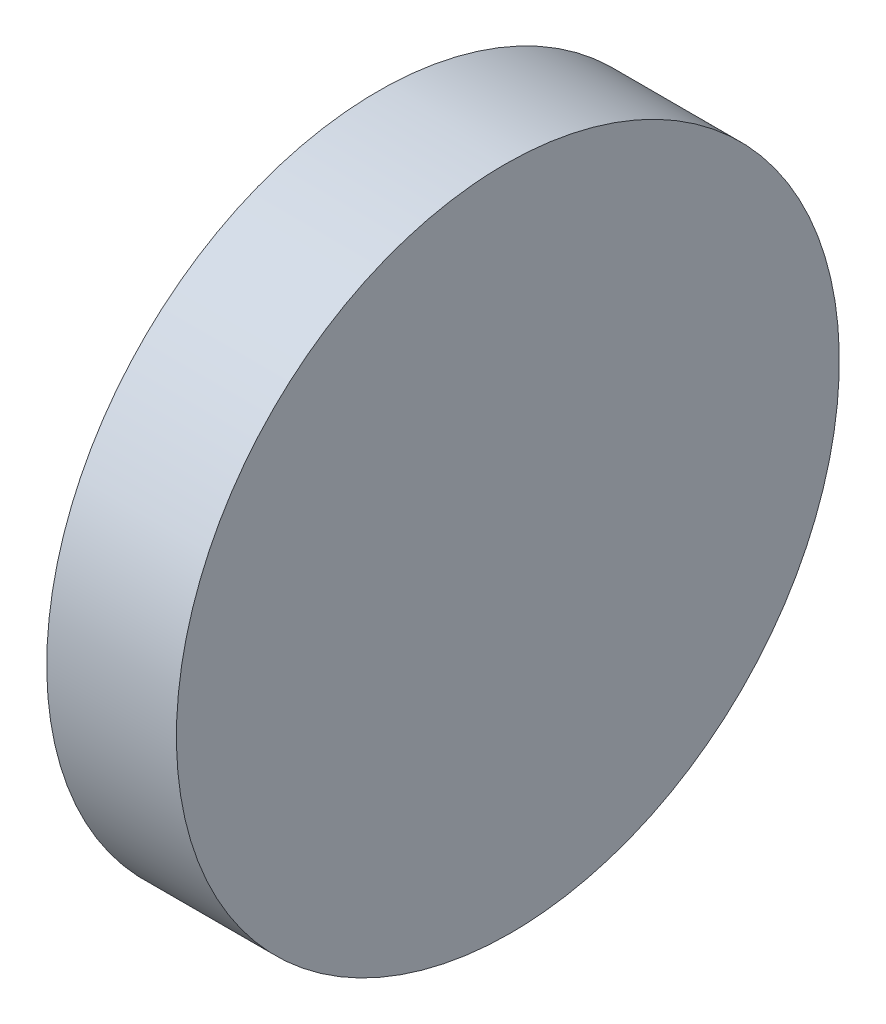
ISO-10303-21;
HEADER;
FILE_DESCRIPTION(('STEP AP214'),'2;1');
FILE_NAME('part.step','',(''),(''),'','','');
FILE_SCHEMA(('AUTOMOTIVE_DESIGN { 1 0 10303 214 1 1 1 1 }'));
ENDSEC;
DATA;
#1=APPLICATION_CONTEXT('core data for automotive mechanical design processes');
#2=APPLICATION_PROTOCOL_DEFINITION('international standard','automotive_design',2000,#1);
#3=PRODUCT_CONTEXT('',#1,'mechanical');
#4=PRODUCT('Part','Part','',(#3));
#5=PRODUCT_RELATED_PRODUCT_CATEGORY('part','',(#4));
#6=PRODUCT_DEFINITION_FORMATION('','',#4);
#7=PRODUCT_DEFINITION_CONTEXT('part definition',#1,'design');
#8=PRODUCT_DEFINITION('design','',#6,#7);
#9=PRODUCT_DEFINITION_SHAPE('','',#8);
#10=(LENGTH_UNIT() NAMED_UNIT(*) SI_UNIT(.MILLI.,.METRE.));
#11=(NAMED_UNIT(*) PLANE_ANGLE_UNIT() SI_UNIT($,.RADIAN.));
#12=(NAMED_UNIT(*) SI_UNIT($,.STERADIAN.) SOLID_ANGLE_UNIT());
#13=UNCERTAINTY_MEASURE_WITH_UNIT(LENGTH_MEASURE(1.E-05),#10,'distance_accuracy_value','');
#14=(GEOMETRIC_REPRESENTATION_CONTEXT(3) GLOBAL_UNCERTAINTY_ASSIGNED_CONTEXT((#13)) GLOBAL_UNIT_ASSIGNED_CONTEXT((#10,
#11,#12)) REPRESENTATION_CONTEXT('',''));
#15=CARTESIAN_POINT('',(0.,0.,0.));
#16=DIRECTION('',(0.,0.,1.));
#17=DIRECTION('',(1.,0.,0.));
#18=AXIS2_PLACEMENT_3D('',#15,#16,#17);
#19=CARTESIAN_POINT('',(0.,25.,50.));
#20=DIRECTION('',(1.,0.,0.));
#21=DIRECTION('',(0.,1.,0.));
#22=AXIS2_PLACEMENT_3D('',#19,#20,#21);
#23=PLANE('',#22);
#24=CARTESIAN_POINT('',(0.,0.,25.));
#25=DIRECTION('',(-1.,0.,0.));
#26=DIRECTION('',(0.,-1.,0.));
#27=AXIS2_PLACEMENT_3D('',#24,#25,#26);
#28=CIRCLE('',#27,25.);
#29=CARTESIAN_POINT('',(0.,-25.,25.));
#30=VERTEX_POINT('',#29);
#31=EDGE_CURVE('E76',#30,#30,#28,.T.);
#32=ORIENTED_EDGE('',*,*,#31,.T.);
#33=EDGE_LOOP('',(#32));
#34=FACE_BOUND('',#33,.T.);
#35=ADVANCED_FACE('F69',(#34),#23,.F.);
#36=CARTESIAN_POINT('',(10.,-25.,50.));
#37=DIRECTION('',(-0.999961923064171,-0.00872653549836698,0.));
#38=DIRECTION('',(0.00872653549836698,-0.999961923064171,0.));
#39=AXIS2_PLACEMENT_3D('',#36,#37,#38);
#40=PLANE('',#39);
#41=CARTESIAN_POINT('',(9.78182830523121,0.,25.));
#42=DIRECTION('',(-0.999961923064171,-0.00872653549836698,0.));
#43=DIRECTION('',(-0.00872653549836698,0.999961923064171,0.));
#44=AXIS2_PLACEMENT_3D('',#41,#42,#43);
#45=ELLIPSE('',#44,25.0009519596434,25.);
#46=CARTESIAN_POINT('',(9.56365661046241,25.,25.));
#47=VERTEX_POINT('',#46);
#48=EDGE_CURVE('E11',#47,#47,#45,.T.);
#49=ORIENTED_EDGE('',*,*,#48,.F.);
#50=EDGE_LOOP('',(#49));
#51=FACE_BOUND('',#50,.T.);
#52=ADVANCED_FACE('F71',(#51),#40,.F.);
#53=CARTESIAN_POINT('',(10.,0.,25.));
#54=DIRECTION('',(-1.,0.,0.));
#55=DIRECTION('',(0.,-1.,0.));
#56=AXIS2_PLACEMENT_3D('',#53,#54,#55);
#57=CYLINDRICAL_SURFACE('',#56,25.);
#58=ORIENTED_EDGE('',*,*,#31,.F.);
#59=EDGE_LOOP('',(#58));
#60=FACE_BOUND('',#59,.T.);
#61=ORIENTED_EDGE('',*,*,#48,.T.);
#62=EDGE_LOOP('',(#61));
#63=FACE_BOUND('',#62,.T.);
#64=ADVANCED_FACE('F83',(#60,#63),#57,.T.);
#65=CLOSED_SHELL('',(#35,#52,#64));
#66=MANIFOLD_SOLID_BREP('B2',#65);
#67=ADVANCED_BREP_SHAPE_REPRESENTATION('',(#18,#66),#14);
#68=SHAPE_DEFINITION_REPRESENTATION(#9,#67);
ENDSEC;
END-ISO-10303-21;
